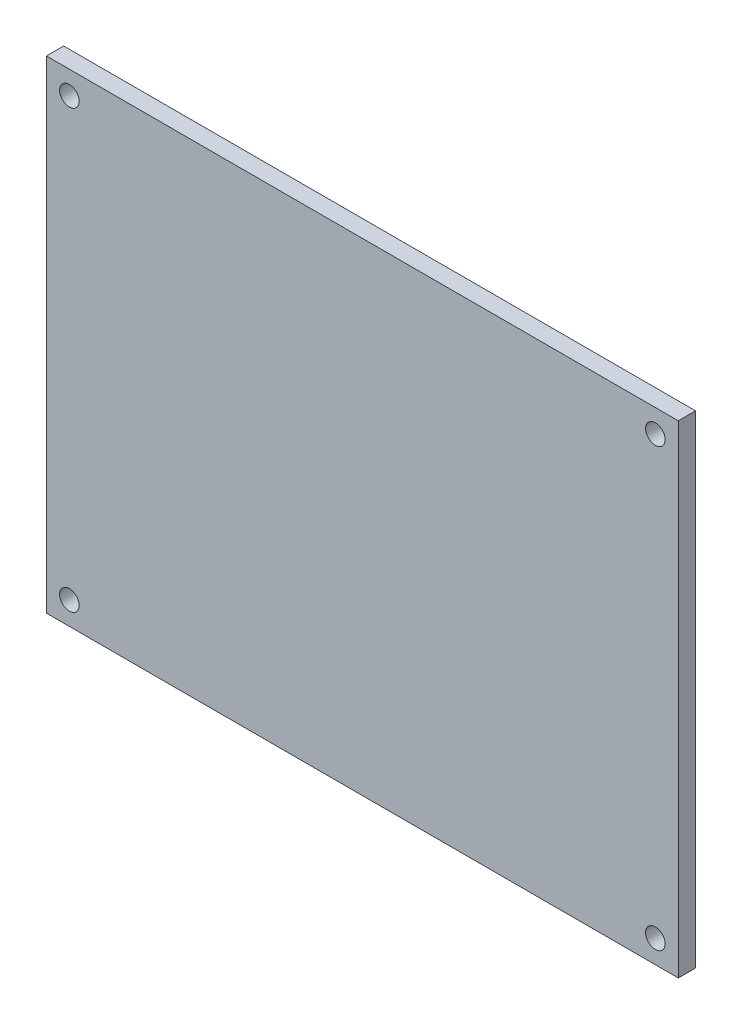
ISO-10303-21;
HEADER;
FILE_DESCRIPTION(('STEP AP214'),'2;1');
FILE_NAME('part.step','',(''),(''),'','','');
FILE_SCHEMA(('AUTOMOTIVE_DESIGN { 1 0 10303 214 1 1 1 1 }'));
ENDSEC;
DATA;
#1=APPLICATION_CONTEXT('core data for automotive mechanical design processes');
#2=APPLICATION_PROTOCOL_DEFINITION('international standard','automotive_design',2000,#1);
#3=PRODUCT_CONTEXT('',#1,'mechanical');
#4=PRODUCT('Part','Part','',(#3));
#5=PRODUCT_RELATED_PRODUCT_CATEGORY('part','',(#4));
#6=PRODUCT_DEFINITION_FORMATION('','',#4);
#7=PRODUCT_DEFINITION_CONTEXT('part definition',#1,'design');
#8=PRODUCT_DEFINITION('design','',#6,#7);
#9=PRODUCT_DEFINITION_SHAPE('','',#8);
#10=(LENGTH_UNIT() NAMED_UNIT(*) SI_UNIT(.MILLI.,.METRE.));
#11=(NAMED_UNIT(*) PLANE_ANGLE_UNIT() SI_UNIT($,.RADIAN.));
#12=(NAMED_UNIT(*) SI_UNIT($,.STERADIAN.) SOLID_ANGLE_UNIT());
#13=UNCERTAINTY_MEASURE_WITH_UNIT(LENGTH_MEASURE(1.E-05),#10,'distance_accuracy_value','');
#14=(GEOMETRIC_REPRESENTATION_CONTEXT(3) GLOBAL_UNCERTAINTY_ASSIGNED_CONTEXT((#13)) GLOBAL_UNIT_ASSIGNED_CONTEXT((#10,
#11,#12)) REPRESENTATION_CONTEXT('',''));
#15=CARTESIAN_POINT('',(0.,0.,0.));
#16=DIRECTION('',(0.,0.,1.));
#17=DIRECTION('',(1.,0.,0.));
#18=AXIS2_PLACEMENT_3D('',#15,#16,#17);
#19=CARTESIAN_POINT('',(0.,0.,3.));
#20=DIRECTION('',(0.,0.,1.));
#21=DIRECTION('',(1.,0.,0.));
#22=AXIS2_PLACEMENT_3D('',#19,#20,#21);
#23=PLANE('',#22);
#24=CARTESIAN_POINT('',(53.8705636743215,-44.9791231732777,3.));
#25=DIRECTION('',(0.,0.,1.));
#26=DIRECTION('',(1.,0.,0.));
#27=AXIS2_PLACEMENT_3D('',#24,#25,#26);
#28=CIRCLE('',#27,1.7);
#29=CARTESIAN_POINT('',(55.5705636743215,-44.9791231732777,3.));
#30=VERTEX_POINT('',#29);
#31=EDGE_CURVE('E142',#30,#30,#28,.T.);
#32=ORIENTED_EDGE('',*,*,#31,.F.);
#33=EDGE_LOOP('',(#32));
#34=FACE_BOUND('',#33,.T.);
#35=CARTESIAN_POINT('',(-48.1294363256785,31.0208768267223,3.));
#36=DIRECTION('',(0.,0.,1.));
#37=DIRECTION('',(1.,0.,0.));
#38=AXIS2_PLACEMENT_3D('',#35,#36,#37);
#39=CIRCLE('',#38,1.7);
#40=CARTESIAN_POINT('',(-46.4294363256785,31.0208768267223,3.));
#41=VERTEX_POINT('',#40);
#42=EDGE_CURVE('E112',#41,#41,#39,.T.);
#43=ORIENTED_EDGE('',*,*,#42,.F.);
#44=EDGE_LOOP('',(#43));
#45=FACE_BOUND('',#44,.T.);
#46=DIRECTION('',(0.,-1.,0.));
#47=VECTOR('',#46,1.);
#48=CARTESIAN_POINT('',(-52.1294363256785,35.0208768267223,3.));
#49=LINE('',#48,#47);
#50=CARTESIAN_POINT('',(-52.1294363256785,35.0208768267223,3.));
#51=VERTEX_POINT('',#50);
#52=CARTESIAN_POINT('',(-52.1294363256785,-48.9791231732777,3.));
#53=VERTEX_POINT('',#52);
#54=EDGE_CURVE('E92',#51,#53,#49,.T.);
#55=ORIENTED_EDGE('',*,*,#54,.T.);
#56=DIRECTION('',(1.,0.,0.));
#57=VECTOR('',#56,1.);
#58=CARTESIAN_POINT('',(-52.1294363256785,-48.9791231732777,3.));
#59=LINE('',#58,#57);
#60=CARTESIAN_POINT('',(57.8705636743215,-48.9791231732777,3.));
#61=VERTEX_POINT('',#60);
#62=EDGE_CURVE('E87',#53,#61,#59,.T.);
#63=ORIENTED_EDGE('',*,*,#62,.T.);
#64=DIRECTION('',(0.,1.,0.));
#65=VECTOR('',#64,1.);
#66=CARTESIAN_POINT('',(57.8705636743215,35.0208768267223,3.));
#67=LINE('',#66,#65);
#68=CARTESIAN_POINT('',(57.8705636743215,35.0208768267223,3.));
#69=VERTEX_POINT('',#68);
#70=EDGE_CURVE('E90',#61,#69,#67,.T.);
#71=ORIENTED_EDGE('',*,*,#70,.T.);
#72=DIRECTION('',(-1.,0.,0.));
#73=VECTOR('',#72,1.);
#74=CARTESIAN_POINT('',(-52.1294363256785,35.0208768267223,3.));
#75=LINE('',#74,#73);
#76=EDGE_CURVE('E57',#69,#51,#75,.T.);
#77=ORIENTED_EDGE('',*,*,#76,.T.);
#78=EDGE_LOOP('',(#55,#63,#71,#77));
#79=FACE_BOUND('',#78,.T.);
#80=CARTESIAN_POINT('',(53.8705636743215,31.0208768267223,3.));
#81=DIRECTION('',(0.,0.,1.));
#82=DIRECTION('',(1.,0.,0.));
#83=AXIS2_PLACEMENT_3D('',#80,#81,#82);
#84=CIRCLE('',#83,1.7);
#85=CARTESIAN_POINT('',(55.5705636743215,31.0208768267223,3.));
#86=VERTEX_POINT('',#85);
#87=EDGE_CURVE('E134',#86,#86,#84,.T.);
#88=ORIENTED_EDGE('',*,*,#87,.F.);
#89=EDGE_LOOP('',(#88));
#90=FACE_BOUND('',#89,.T.);
#91=CARTESIAN_POINT('',(-48.1294363256785,-44.9791231732777,3.));
#92=DIRECTION('',(0.,0.,1.));
#93=DIRECTION('',(1.,0.,0.));
#94=AXIS2_PLACEMENT_3D('',#91,#92,#93);
#95=CIRCLE('',#94,1.7);
#96=CARTESIAN_POINT('',(-46.4294363256785,-44.9791231732777,3.));
#97=VERTEX_POINT('',#96);
#98=EDGE_CURVE('E150',#97,#97,#95,.T.);
#99=ORIENTED_EDGE('',*,*,#98,.F.);
#100=EDGE_LOOP('',(#99));
#101=FACE_BOUND('',#100,.T.);
#102=ADVANCED_FACE('F39',(#34,#45,#79,#90,#101),#23,.T.);
#103=CARTESIAN_POINT('',(0.,0.,0.));
#104=DIRECTION('',(0.,0.,1.));
#105=DIRECTION('',(1.,0.,0.));
#106=AXIS2_PLACEMENT_3D('',#103,#104,#105);
#107=PLANE('',#106);
#108=DIRECTION('',(0.,-1.,0.));
#109=VECTOR('',#108,1.);
#110=CARTESIAN_POINT('',(-52.1294363256785,35.0208768267223,0.));
#111=LINE('',#110,#109);
#112=CARTESIAN_POINT('',(-52.1294363256785,35.0208768267223,0.));
#113=VERTEX_POINT('',#112);
#114=CARTESIAN_POINT('',(-52.1294363256785,-48.9791231732777,0.));
#115=VERTEX_POINT('',#114);
#116=EDGE_CURVE('E108',#113,#115,#111,.T.);
#117=ORIENTED_EDGE('',*,*,#116,.F.);
#118=DIRECTION('',(-1.,0.,0.));
#119=VECTOR('',#118,1.);
#120=CARTESIAN_POINT('',(-52.1294363256785,35.0208768267223,0.));
#121=LINE('',#120,#119);
#122=CARTESIAN_POINT('',(57.8705636743215,35.0208768267223,0.));
#123=VERTEX_POINT('',#122);
#124=EDGE_CURVE('E80',#123,#113,#121,.T.);
#125=ORIENTED_EDGE('',*,*,#124,.F.);
#126=DIRECTION('',(0.,1.,0.));
#127=VECTOR('',#126,1.);
#128=CARTESIAN_POINT('',(57.8705636743215,35.0208768267223,0.));
#129=LINE('',#128,#127);
#130=CARTESIAN_POINT('',(57.8705636743215,-48.9791231732777,0.));
#131=VERTEX_POINT('',#130);
#132=EDGE_CURVE('E74',#131,#123,#129,.T.);
#133=ORIENTED_EDGE('',*,*,#132,.F.);
#134=DIRECTION('',(1.,0.,0.));
#135=VECTOR('',#134,1.);
#136=CARTESIAN_POINT('',(-52.1294363256785,-48.9791231732777,0.));
#137=LINE('',#136,#135);
#138=EDGE_CURVE('E97',#115,#131,#137,.T.);
#139=ORIENTED_EDGE('',*,*,#138,.F.);
#140=EDGE_LOOP('',(#117,#125,#133,#139));
#141=FACE_BOUND('',#140,.T.);
#142=CARTESIAN_POINT('',(-48.1294363256785,31.0208768267223,0.));
#143=DIRECTION('',(0.,0.,1.));
#144=DIRECTION('',(1.,0.,0.));
#145=AXIS2_PLACEMENT_3D('',#142,#143,#144);
#146=CIRCLE('',#145,1.7);
#147=CARTESIAN_POINT('',(-46.4294363256785,31.0208768267223,0.));
#148=VERTEX_POINT('',#147);
#149=EDGE_CURVE('E130',#148,#148,#146,.T.);
#150=ORIENTED_EDGE('',*,*,#149,.T.);
#151=EDGE_LOOP('',(#150));
#152=FACE_BOUND('',#151,.T.);
#153=CARTESIAN_POINT('',(53.8705636743215,31.0208768267223,0.));
#154=DIRECTION('',(0.,0.,1.));
#155=DIRECTION('',(1.,0.,0.));
#156=AXIS2_PLACEMENT_3D('',#153,#154,#155);
#157=CIRCLE('',#156,1.7);
#158=CARTESIAN_POINT('',(55.5705636743215,31.0208768267223,0.));
#159=VERTEX_POINT('',#158);
#160=EDGE_CURVE('E138',#159,#159,#157,.T.);
#161=ORIENTED_EDGE('',*,*,#160,.T.);
#162=EDGE_LOOP('',(#161));
#163=FACE_BOUND('',#162,.T.);
#164=CARTESIAN_POINT('',(53.8705636743215,-44.9791231732777,0.));
#165=DIRECTION('',(0.,0.,1.));
#166=DIRECTION('',(1.,0.,0.));
#167=AXIS2_PLACEMENT_3D('',#164,#165,#166);
#168=CIRCLE('',#167,1.7);
#169=CARTESIAN_POINT('',(55.5705636743215,-44.9791231732777,0.));
#170=VERTEX_POINT('',#169);
#171=EDGE_CURVE('E146',#170,#170,#168,.T.);
#172=ORIENTED_EDGE('',*,*,#171,.T.);
#173=EDGE_LOOP('',(#172));
#174=FACE_BOUND('',#173,.T.);
#175=CARTESIAN_POINT('',(-48.1294363256785,-44.9791231732777,0.));
#176=DIRECTION('',(0.,0.,1.));
#177=DIRECTION('',(1.,0.,0.));
#178=AXIS2_PLACEMENT_3D('',#175,#176,#177);
#179=CIRCLE('',#178,1.7);
#180=CARTESIAN_POINT('',(-46.4294363256785,-44.9791231732777,0.));
#181=VERTEX_POINT('',#180);
#182=EDGE_CURVE('E154',#181,#181,#179,.T.);
#183=ORIENTED_EDGE('',*,*,#182,.T.);
#184=EDGE_LOOP('',(#183));
#185=FACE_BOUND('',#184,.T.);
#186=ADVANCED_FACE('F125',(#141,#152,#163,#174,#185),#107,.F.);
#187=CARTESIAN_POINT('',(-52.1294363256785,35.0208768267223,3.));
#188=DIRECTION('',(1.,0.,0.));
#189=DIRECTION('',(0.,0.,-1.));
#190=AXIS2_PLACEMENT_3D('',#187,#188,#189);
#191=PLANE('',#190);
#192=ORIENTED_EDGE('',*,*,#116,.T.);
#193=DIRECTION('',(0.,0.,-1.));
#194=VECTOR('',#193,1.);
#195=CARTESIAN_POINT('',(-52.1294363256785,-48.9791231732777,3.));
#196=LINE('',#195,#194);
#197=EDGE_CURVE('E11',#53,#115,#196,.T.);
#198=ORIENTED_EDGE('',*,*,#197,.F.);
#199=ORIENTED_EDGE('',*,*,#54,.F.);
#200=DIRECTION('',(0.,0.,-1.));
#201=VECTOR('',#200,1.);
#202=CARTESIAN_POINT('',(-52.1294363256785,35.0208768267223,3.));
#203=LINE('',#202,#201);
#204=EDGE_CURVE('E104',#51,#113,#203,.T.);
#205=ORIENTED_EDGE('',*,*,#204,.T.);
#206=EDGE_LOOP('',(#192,#198,#199,#205));
#207=FACE_BOUND('',#206,.T.);
#208=ADVANCED_FACE('F41',(#207),#191,.F.);
#209=CARTESIAN_POINT('',(-52.1294363256785,-48.9791231732777,3.));
#210=DIRECTION('',(0.,1.,0.));
#211=DIRECTION('',(0.,0.,1.));
#212=AXIS2_PLACEMENT_3D('',#209,#210,#211);
#213=PLANE('',#212);
#214=ORIENTED_EDGE('',*,*,#138,.T.);
#215=DIRECTION('',(0.,0.,-1.));
#216=VECTOR('',#215,1.);
#217=CARTESIAN_POINT('',(57.8705636743215,-48.9791231732777,3.));
#218=LINE('',#217,#216);
#219=EDGE_CURVE('E49',#61,#131,#218,.T.);
#220=ORIENTED_EDGE('',*,*,#219,.F.);
#221=ORIENTED_EDGE('',*,*,#62,.F.);
#222=ORIENTED_EDGE('',*,*,#197,.T.);
#223=EDGE_LOOP('',(#214,#220,#221,#222));
#224=FACE_BOUND('',#223,.T.);
#225=ADVANCED_FACE('F96',(#224),#213,.F.);
#226=CARTESIAN_POINT('',(57.8705636743215,35.0208768267223,3.));
#227=DIRECTION('',(-1.,0.,0.));
#228=DIRECTION('',(0.,0.,1.));
#229=AXIS2_PLACEMENT_3D('',#226,#227,#228);
#230=PLANE('',#229);
#231=ORIENTED_EDGE('',*,*,#132,.T.);
#232=DIRECTION('',(0.,0.,-1.));
#233=VECTOR('',#232,1.);
#234=CARTESIAN_POINT('',(57.8705636743215,35.0208768267223,3.));
#235=LINE('',#234,#233);
#236=EDGE_CURVE('E99',#69,#123,#235,.T.);
#237=ORIENTED_EDGE('',*,*,#236,.F.);
#238=ORIENTED_EDGE('',*,*,#70,.F.);
#239=ORIENTED_EDGE('',*,*,#219,.T.);
#240=EDGE_LOOP('',(#231,#237,#238,#239));
#241=FACE_BOUND('',#240,.T.);
#242=ADVANCED_FACE('F100',(#241),#230,.F.);
#243=CARTESIAN_POINT('',(-52.1294363256785,35.0208768267223,3.));
#244=DIRECTION('',(0.,-1.,0.));
#245=DIRECTION('',(0.,0.,-1.));
#246=AXIS2_PLACEMENT_3D('',#243,#244,#245);
#247=PLANE('',#246);
#248=ORIENTED_EDGE('',*,*,#124,.T.);
#249=ORIENTED_EDGE('',*,*,#204,.F.);
#250=ORIENTED_EDGE('',*,*,#76,.F.);
#251=ORIENTED_EDGE('',*,*,#236,.T.);
#252=EDGE_LOOP('',(#248,#249,#250,#251));
#253=FACE_BOUND('',#252,.T.);
#254=ADVANCED_FACE('F122',(#253),#247,.F.);
#255=CARTESIAN_POINT('',(-48.1294363256785,31.0208768267223,3.));
#256=DIRECTION('',(0.,0.,-1.));
#257=DIRECTION('',(-1.,0.,0.));
#258=AXIS2_PLACEMENT_3D('',#255,#256,#257);
#259=CYLINDRICAL_SURFACE('',#258,1.7);
#260=ORIENTED_EDGE('',*,*,#42,.T.);
#261=EDGE_LOOP('',(#260));
#262=FACE_BOUND('',#261,.T.);
#263=ORIENTED_EDGE('',*,*,#149,.F.);
#264=EDGE_LOOP('',(#263));
#265=FACE_BOUND('',#264,.T.);
#266=ADVANCED_FACE('F175',(#262,#265),#259,.F.);
#267=CARTESIAN_POINT('',(53.8705636743215,31.0208768267223,3.));
#268=DIRECTION('',(0.,0.,-1.));
#269=DIRECTION('',(-1.,0.,0.));
#270=AXIS2_PLACEMENT_3D('',#267,#268,#269);
#271=CYLINDRICAL_SURFACE('',#270,1.7);
#272=ORIENTED_EDGE('',*,*,#87,.T.);
#273=EDGE_LOOP('',(#272));
#274=FACE_BOUND('',#273,.T.);
#275=ORIENTED_EDGE('',*,*,#160,.F.);
#276=EDGE_LOOP('',(#275));
#277=FACE_BOUND('',#276,.T.);
#278=ADVANCED_FACE('F221',(#274,#277),#271,.F.);
#279=CARTESIAN_POINT('',(53.8705636743215,-44.9791231732777,3.));
#280=DIRECTION('',(0.,0.,-1.));
#281=DIRECTION('',(-1.,0.,0.));
#282=AXIS2_PLACEMENT_3D('',#279,#280,#281);
#283=CYLINDRICAL_SURFACE('',#282,1.7);
#284=ORIENTED_EDGE('',*,*,#31,.T.);
#285=EDGE_LOOP('',(#284));
#286=FACE_BOUND('',#285,.T.);
#287=ORIENTED_EDGE('',*,*,#171,.F.);
#288=EDGE_LOOP('',(#287));
#289=FACE_BOUND('',#288,.T.);
#290=ADVANCED_FACE('F229',(#286,#289),#283,.F.);
#291=CARTESIAN_POINT('',(-48.1294363256785,-44.9791231732777,3.));
#292=DIRECTION('',(0.,0.,-1.));
#293=DIRECTION('',(-1.,0.,0.));
#294=AXIS2_PLACEMENT_3D('',#291,#292,#293);
#295=CYLINDRICAL_SURFACE('',#294,1.7);
#296=ORIENTED_EDGE('',*,*,#98,.T.);
#297=EDGE_LOOP('',(#296));
#298=FACE_BOUND('',#297,.T.);
#299=ORIENTED_EDGE('',*,*,#182,.F.);
#300=EDGE_LOOP('',(#299));
#301=FACE_BOUND('',#300,.T.);
#302=ADVANCED_FACE('F162',(#298,#301),#295,.F.);
#303=CLOSED_SHELL('',(#102,#186,#208,#225,#242,#254,#266,#278,#290,#302));
#304=MANIFOLD_SOLID_BREP('B2',#303);
#305=ADVANCED_BREP_SHAPE_REPRESENTATION('',(#18,#304),#14);
#306=SHAPE_DEFINITION_REPRESENTATION(#9,#305);
ENDSEC;
END-ISO-10303-21;
